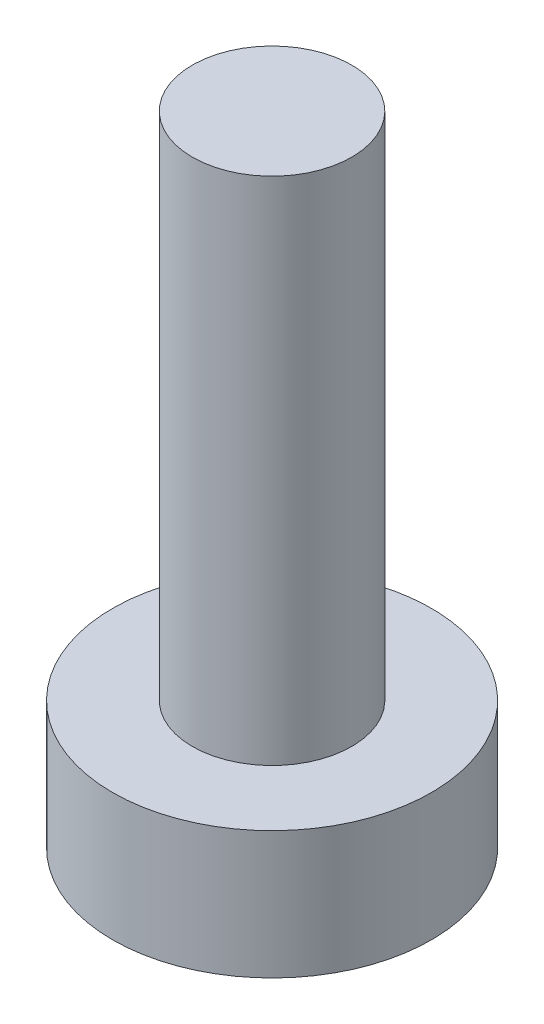
ISO-10303-21;
HEADER;
FILE_DESCRIPTION(('STEP AP214'),'2;1');
FILE_NAME('part.step','',(''),(''),'','','');
FILE_SCHEMA(('AUTOMOTIVE_DESIGN { 1 0 10303 214 1 1 1 1 }'));
ENDSEC;
DATA;
#1=APPLICATION_CONTEXT('core data for automotive mechanical design processes');
#2=APPLICATION_PROTOCOL_DEFINITION('international standard','automotive_design',2000,#1);
#3=PRODUCT_CONTEXT('',#1,'mechanical');
#4=PRODUCT('Part','Part','',(#3));
#5=PRODUCT_RELATED_PRODUCT_CATEGORY('part','',(#4));
#6=PRODUCT_DEFINITION_FORMATION('','',#4);
#7=PRODUCT_DEFINITION_CONTEXT('part definition',#1,'design');
#8=PRODUCT_DEFINITION('design','',#6,#7);
#9=PRODUCT_DEFINITION_SHAPE('','',#8);
#10=(LENGTH_UNIT() NAMED_UNIT(*) SI_UNIT(.MILLI.,.METRE.));
#11=(NAMED_UNIT(*) PLANE_ANGLE_UNIT() SI_UNIT($,.RADIAN.));
#12=(NAMED_UNIT(*) SI_UNIT($,.STERADIAN.) SOLID_ANGLE_UNIT());
#13=UNCERTAINTY_MEASURE_WITH_UNIT(LENGTH_MEASURE(1.E-05),#10,'distance_accuracy_value','');
#14=(GEOMETRIC_REPRESENTATION_CONTEXT(3) GLOBAL_UNCERTAINTY_ASSIGNED_CONTEXT((#13)) GLOBAL_UNIT_ASSIGNED_CONTEXT((#10,
#11,#12)) REPRESENTATION_CONTEXT('',''));
#15=CARTESIAN_POINT('',(0.,0.,0.));
#16=DIRECTION('',(0.,0.,1.));
#17=DIRECTION('',(1.,0.,0.));
#18=AXIS2_PLACEMENT_3D('',#15,#16,#17);
#19=CARTESIAN_POINT('',(0.,2.,0.));
#20=DIRECTION('',(0.,1.,0.));
#21=DIRECTION('',(0.,0.,1.));
#22=AXIS2_PLACEMENT_3D('',#19,#20,#21);
#23=PLANE('',#22);
#24=CARTESIAN_POINT('',(0.,2.,0.));
#25=DIRECTION('',(0.,1.,0.));
#26=DIRECTION('',(0.,0.,1.));
#27=AXIS2_PLACEMENT_3D('',#24,#25,#26);
#28=CIRCLE('',#27,2.5);
#29=CARTESIAN_POINT('',(0.,2.,2.5));
#30=VERTEX_POINT('',#29);
#31=EDGE_CURVE('E10',#30,#30,#28,.T.);
#32=ORIENTED_EDGE('',*,*,#31,.T.);
#33=EDGE_LOOP('',(#32));
#34=FACE_BOUND('',#33,.T.);
#35=CARTESIAN_POINT('',(0.,2.,0.));
#36=DIRECTION('',(0.,1.,0.));
#37=DIRECTION('',(0.,0.,1.));
#38=AXIS2_PLACEMENT_3D('',#35,#36,#37);
#39=CIRCLE('',#38,1.25);
#40=CARTESIAN_POINT('',(0.,2.,1.25));
#41=VERTEX_POINT('',#40);
#42=EDGE_CURVE('E44',#41,#41,#39,.T.);
#43=ORIENTED_EDGE('',*,*,#42,.F.);
#44=EDGE_LOOP('',(#43));
#45=FACE_BOUND('',#44,.T.);
#46=ADVANCED_FACE('F31',(#34,#45),#23,.T.);
#47=CARTESIAN_POINT('',(0.,2.,0.));
#48=DIRECTION('',(0.,-1.,0.));
#49=DIRECTION('',(0.,0.,-1.));
#50=AXIS2_PLACEMENT_3D('',#47,#48,#49);
#51=CYLINDRICAL_SURFACE('',#50,2.5);
#52=ORIENTED_EDGE('',*,*,#31,.F.);
#53=EDGE_LOOP('',(#52));
#54=FACE_BOUND('',#53,.T.);
#55=CARTESIAN_POINT('',(0.,0.,0.));
#56=DIRECTION('',(0.,1.,0.));
#57=DIRECTION('',(0.,0.,1.));
#58=AXIS2_PLACEMENT_3D('',#55,#56,#57);
#59=CIRCLE('',#58,2.5);
#60=CARTESIAN_POINT('',(0.,0.,2.5));
#61=VERTEX_POINT('',#60);
#62=EDGE_CURVE('E35',#61,#61,#59,.T.);
#63=ORIENTED_EDGE('',*,*,#62,.T.);
#64=EDGE_LOOP('',(#63));
#65=FACE_BOUND('',#64,.T.);
#66=ADVANCED_FACE('F33',(#54,#65),#51,.T.);
#67=CARTESIAN_POINT('',(0.,0.,0.));
#68=DIRECTION('',(0.,1.,0.));
#69=DIRECTION('',(0.,0.,1.));
#70=AXIS2_PLACEMENT_3D('',#67,#68,#69);
#71=PLANE('',#70);
#72=ORIENTED_EDGE('',*,*,#62,.F.);
#73=EDGE_LOOP('',(#72));
#74=FACE_BOUND('',#73,.T.);
#75=ADVANCED_FACE('F55',(#74),#71,.F.);
#76=CARTESIAN_POINT('',(0.,10.,0.));
#77=DIRECTION('',(0.,-1.,0.));
#78=DIRECTION('',(0.,0.,-1.));
#79=AXIS2_PLACEMENT_3D('',#76,#77,#78);
#80=CYLINDRICAL_SURFACE('',#79,1.25);
#81=CARTESIAN_POINT('',(0.,10.,0.));
#82=DIRECTION('',(0.,1.,0.));
#83=DIRECTION('',(0.,0.,1.));
#84=AXIS2_PLACEMENT_3D('',#81,#82,#83);
#85=CIRCLE('',#84,1.25);
#86=CARTESIAN_POINT('',(0.,10.,1.25));
#87=VERTEX_POINT('',#86);
#88=EDGE_CURVE('E42',#87,#87,#85,.T.);
#89=ORIENTED_EDGE('',*,*,#88,.F.);
#90=EDGE_LOOP('',(#89));
#91=FACE_BOUND('',#90,.T.);
#92=ORIENTED_EDGE('',*,*,#42,.T.);
#93=EDGE_LOOP('',(#92));
#94=FACE_BOUND('',#93,.T.);
#95=ADVANCED_FACE('F52',(#91,#94),#80,.T.);
#96=CARTESIAN_POINT('',(0.,10.,0.));
#97=DIRECTION('',(0.,1.,0.));
#98=DIRECTION('',(0.,0.,1.));
#99=AXIS2_PLACEMENT_3D('',#96,#97,#98);
#100=PLANE('',#99);
#101=ORIENTED_EDGE('',*,*,#88,.T.);
#102=EDGE_LOOP('',(#101));
#103=FACE_BOUND('',#102,.T.);
#104=ADVANCED_FACE('F50',(#103),#100,.T.);
#105=CLOSED_SHELL('',(#46,#66,#75,#95,#104));
#106=MANIFOLD_SOLID_BREP('B2',#105);
#107=ADVANCED_BREP_SHAPE_REPRESENTATION('',(#18,#106),#14);
#108=SHAPE_DEFINITION_REPRESENTATION(#9,#107);
ENDSEC;
END-ISO-10303-21;
